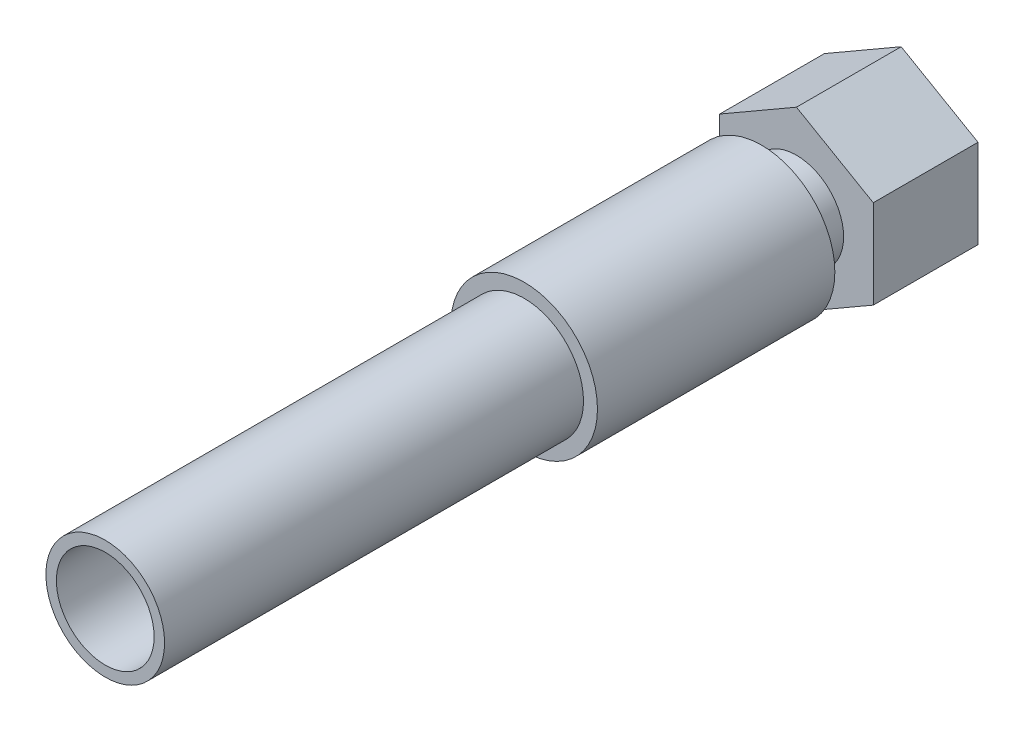
ISO-10303-21;
HEADER;
FILE_DESCRIPTION(('STEP AP214'),'2;1');
FILE_NAME('part.step','',(''),(''),'','','');
FILE_SCHEMA(('AUTOMOTIVE_DESIGN { 1 0 10303 214 1 1 1 1 }'));
ENDSEC;
DATA;
#1=APPLICATION_CONTEXT('core data for automotive mechanical design processes');
#2=APPLICATION_PROTOCOL_DEFINITION('international standard','automotive_design',2000,#1);
#3=PRODUCT_CONTEXT('',#1,'mechanical');
#4=PRODUCT('Part','Part','',(#3));
#5=PRODUCT_RELATED_PRODUCT_CATEGORY('part','',(#4));
#6=PRODUCT_DEFINITION_FORMATION('','',#4);
#7=PRODUCT_DEFINITION_CONTEXT('part definition',#1,'design');
#8=PRODUCT_DEFINITION('design','',#6,#7);
#9=PRODUCT_DEFINITION_SHAPE('','',#8);
#10=(LENGTH_UNIT() NAMED_UNIT(*) SI_UNIT(.MILLI.,.METRE.));
#11=(NAMED_UNIT(*) PLANE_ANGLE_UNIT() SI_UNIT($,.RADIAN.));
#12=(NAMED_UNIT(*) SI_UNIT($,.STERADIAN.) SOLID_ANGLE_UNIT());
#13=UNCERTAINTY_MEASURE_WITH_UNIT(LENGTH_MEASURE(1.E-05),#10,'distance_accuracy_value','');
#14=(GEOMETRIC_REPRESENTATION_CONTEXT(3) GLOBAL_UNCERTAINTY_ASSIGNED_CONTEXT((#13)) GLOBAL_UNIT_ASSIGNED_CONTEXT((#10,
#11,#12)) REPRESENTATION_CONTEXT('',''));
#15=CARTESIAN_POINT('',(0.,0.,0.));
#16=DIRECTION('',(0.,0.,1.));
#17=DIRECTION('',(1.,0.,0.));
#18=AXIS2_PLACEMENT_3D('',#15,#16,#17);
#19=CARTESIAN_POINT('',(11.,6.35085296108589,15.));
#20=DIRECTION('',(-0.5,-0.866025403784439,0.));
#21=DIRECTION('',(0.866025403784439,-0.5,0.));
#22=AXIS2_PLACEMENT_3D('',#19,#20,#21);
#23=PLANE('',#22);
#24=DIRECTION('',(-0.866025403784439,0.5,0.));
#25=VECTOR('',#24,1.);
#26=CARTESIAN_POINT('',(11.,6.35085296108589,0.));
#27=LINE('',#26,#25);
#28=CARTESIAN_POINT('',(11.,6.35085296108589,0.));
#29=VERTEX_POINT('',#28);
#30=CARTESIAN_POINT('',(0.,12.7017059221718,0.));
#31=VERTEX_POINT('',#30);
#32=EDGE_CURVE('E128',#29,#31,#27,.T.);
#33=ORIENTED_EDGE('',*,*,#32,.T.);
#34=DIRECTION('',(0.,0.,-1.));
#35=VECTOR('',#34,1.);
#36=CARTESIAN_POINT('',(0.,12.7017059221718,15.));
#37=LINE('',#36,#35);
#38=CARTESIAN_POINT('',(0.,12.7017059221718,15.));
#39=VERTEX_POINT('',#38);
#40=EDGE_CURVE('E11',#39,#31,#37,.T.);
#41=ORIENTED_EDGE('',*,*,#40,.F.);
#42=DIRECTION('',(-0.866025403784439,0.5,0.));
#43=VECTOR('',#42,1.);
#44=CARTESIAN_POINT('',(11.,6.35085296108589,15.));
#45=LINE('',#44,#43);
#46=CARTESIAN_POINT('',(11.,6.35085296108589,15.));
#47=VERTEX_POINT('',#46);
#48=EDGE_CURVE('E139',#47,#39,#45,.T.);
#49=ORIENTED_EDGE('',*,*,#48,.F.);
#50=DIRECTION('',(0.,0.,-1.));
#51=VECTOR('',#50,1.);
#52=CARTESIAN_POINT('',(11.,6.35085296108589,15.));
#53=LINE('',#52,#51);
#54=EDGE_CURVE('E124',#47,#29,#53,.T.);
#55=ORIENTED_EDGE('',*,*,#54,.T.);
#56=EDGE_LOOP('',(#33,#41,#49,#55));
#57=FACE_BOUND('',#56,.T.);
#58=ADVANCED_FACE('F43',(#57),#23,.F.);
#59=CARTESIAN_POINT('',(0.,12.7017059221718,15.));
#60=DIRECTION('',(0.5,-0.866025403784439,0.));
#61=DIRECTION('',(0.866025403784439,0.5,0.));
#62=AXIS2_PLACEMENT_3D('',#59,#60,#61);
#63=PLANE('',#62);
#64=DIRECTION('',(-0.866025403784439,-0.5,0.));
#65=VECTOR('',#64,1.);
#66=CARTESIAN_POINT('',(0.,12.7017059221718,0.));
#67=LINE('',#66,#65);
#68=CARTESIAN_POINT('',(-11.,6.35085296108589,0.));
#69=VERTEX_POINT('',#68);
#70=EDGE_CURVE('E131',#31,#69,#67,.T.);
#71=ORIENTED_EDGE('',*,*,#70,.T.);
#72=DIRECTION('',(0.,0.,-1.));
#73=VECTOR('',#72,1.);
#74=CARTESIAN_POINT('',(-11.,6.35085296108589,15.));
#75=LINE('',#74,#73);
#76=CARTESIAN_POINT('',(-11.,6.35085296108589,15.));
#77=VERTEX_POINT('',#76);
#78=EDGE_CURVE('E52',#77,#69,#75,.T.);
#79=ORIENTED_EDGE('',*,*,#78,.F.);
#80=DIRECTION('',(-0.866025403784439,-0.5,0.));
#81=VECTOR('',#80,1.);
#82=CARTESIAN_POINT('',(0.,12.7017059221718,15.));
#83=LINE('',#82,#81);
#84=EDGE_CURVE('E97',#39,#77,#83,.T.);
#85=ORIENTED_EDGE('',*,*,#84,.F.);
#86=ORIENTED_EDGE('',*,*,#40,.T.);
#87=EDGE_LOOP('',(#71,#79,#85,#86));
#88=FACE_BOUND('',#87,.T.);
#89=ADVANCED_FACE('F165',(#88),#63,.F.);
#90=CARTESIAN_POINT('',(-11.,6.35085296108589,15.));
#91=DIRECTION('',(1.,0.,0.));
#92=DIRECTION('',(0.,0.,-1.));
#93=AXIS2_PLACEMENT_3D('',#90,#91,#92);
#94=PLANE('',#93);
#95=DIRECTION('',(0.,-1.,0.));
#96=VECTOR('',#95,1.);
#97=CARTESIAN_POINT('',(-11.,6.35085296108589,0.));
#98=LINE('',#97,#96);
#99=CARTESIAN_POINT('',(-11.,-6.35085296108588,0.));
#100=VERTEX_POINT('',#99);
#101=EDGE_CURVE('E134',#69,#100,#98,.T.);
#102=ORIENTED_EDGE('',*,*,#101,.T.);
#103=DIRECTION('',(0.,0.,-1.));
#104=VECTOR('',#103,1.);
#105=CARTESIAN_POINT('',(-11.,-6.35085296108588,15.));
#106=LINE('',#105,#104);
#107=CARTESIAN_POINT('',(-11.,-6.35085296108588,15.));
#108=VERTEX_POINT('',#107);
#109=EDGE_CURVE('E119',#108,#100,#106,.T.);
#110=ORIENTED_EDGE('',*,*,#109,.F.);
#111=DIRECTION('',(0.,-1.,0.));
#112=VECTOR('',#111,1.);
#113=CARTESIAN_POINT('',(-11.,6.35085296108589,15.));
#114=LINE('',#113,#112);
#115=EDGE_CURVE('E110',#77,#108,#114,.T.);
#116=ORIENTED_EDGE('',*,*,#115,.F.);
#117=ORIENTED_EDGE('',*,*,#78,.T.);
#118=EDGE_LOOP('',(#102,#110,#116,#117));
#119=FACE_BOUND('',#118,.T.);
#120=ADVANCED_FACE('F146',(#119),#94,.F.);
#121=CARTESIAN_POINT('',(-11.,-6.35085296108588,15.));
#122=DIRECTION('',(0.5,0.866025403784439,0.));
#123=DIRECTION('',(-0.866025403784439,0.5,0.));
#124=AXIS2_PLACEMENT_3D('',#121,#122,#123);
#125=PLANE('',#124);
#126=DIRECTION('',(0.866025403784438,-0.5,0.));
#127=VECTOR('',#126,1.);
#128=CARTESIAN_POINT('',(-11.,-6.35085296108588,0.));
#129=LINE('',#128,#127);
#130=CARTESIAN_POINT('',(0.,-12.7017059221718,0.));
#131=VERTEX_POINT('',#130);
#132=EDGE_CURVE('E118',#100,#131,#129,.T.);
#133=ORIENTED_EDGE('',*,*,#132,.T.);
#134=DIRECTION('',(0.,0.,-1.));
#135=VECTOR('',#134,1.);
#136=CARTESIAN_POINT('',(0.,-12.7017059221718,15.));
#137=LINE('',#136,#135);
#138=CARTESIAN_POINT('',(0.,-12.7017059221718,15.));
#139=VERTEX_POINT('',#138);
#140=EDGE_CURVE('E115',#139,#131,#137,.T.);
#141=ORIENTED_EDGE('',*,*,#140,.F.);
#142=DIRECTION('',(0.866025403784438,-0.5,0.));
#143=VECTOR('',#142,1.);
#144=CARTESIAN_POINT('',(-11.,-6.35085296108588,15.));
#145=LINE('',#144,#143);
#146=EDGE_CURVE('E104',#108,#139,#145,.T.);
#147=ORIENTED_EDGE('',*,*,#146,.F.);
#148=ORIENTED_EDGE('',*,*,#109,.T.);
#149=EDGE_LOOP('',(#133,#141,#147,#148));
#150=FACE_BOUND('',#149,.T.);
#151=ADVANCED_FACE('F116',(#150),#125,.F.);
#152=CARTESIAN_POINT('',(0.,-12.7017059221718,15.));
#153=DIRECTION('',(-0.5,0.866025403784439,0.));
#154=DIRECTION('',(-0.866025403784439,-0.5,0.));
#155=AXIS2_PLACEMENT_3D('',#152,#153,#154);
#156=PLANE('',#155);
#157=DIRECTION('',(0.866025403784439,0.5,0.));
#158=VECTOR('',#157,1.);
#159=CARTESIAN_POINT('',(0.,-12.7017059221718,0.));
#160=LINE('',#159,#158);
#161=CARTESIAN_POINT('',(11.,-6.35085296108589,0.));
#162=VERTEX_POINT('',#161);
#163=EDGE_CURVE('E83',#131,#162,#160,.T.);
#164=ORIENTED_EDGE('',*,*,#163,.T.);
#165=DIRECTION('',(0.,0.,-1.));
#166=VECTOR('',#165,1.);
#167=CARTESIAN_POINT('',(11.,-6.35085296108589,15.));
#168=LINE('',#167,#166);
#169=CARTESIAN_POINT('',(11.,-6.35085296108589,15.));
#170=VERTEX_POINT('',#169);
#171=EDGE_CURVE('E120',#170,#162,#168,.T.);
#172=ORIENTED_EDGE('',*,*,#171,.F.);
#173=DIRECTION('',(0.866025403784439,0.5,0.));
#174=VECTOR('',#173,1.);
#175=CARTESIAN_POINT('',(0.,-12.7017059221718,15.));
#176=LINE('',#175,#174);
#177=EDGE_CURVE('E108',#139,#170,#176,.T.);
#178=ORIENTED_EDGE('',*,*,#177,.F.);
#179=ORIENTED_EDGE('',*,*,#140,.T.);
#180=EDGE_LOOP('',(#164,#172,#178,#179));
#181=FACE_BOUND('',#180,.T.);
#182=ADVANCED_FACE('F122',(#181),#156,.F.);
#183=CARTESIAN_POINT('',(11.,-6.35085296108589,15.));
#184=DIRECTION('',(-1.,0.,0.));
#185=DIRECTION('',(0.,-1.,0.));
#186=AXIS2_PLACEMENT_3D('',#183,#184,#185);
#187=PLANE('',#186);
#188=DIRECTION('',(0.,1.,0.));
#189=VECTOR('',#188,1.);
#190=CARTESIAN_POINT('',(11.,-6.35085296108589,0.));
#191=LINE('',#190,#189);
#192=EDGE_CURVE('E89',#162,#29,#191,.T.);
#193=ORIENTED_EDGE('',*,*,#192,.T.);
#194=ORIENTED_EDGE('',*,*,#54,.F.);
#195=DIRECTION('',(0.,1.,0.));
#196=VECTOR('',#195,1.);
#197=CARTESIAN_POINT('',(11.,-6.35085296108589,15.));
#198=LINE('',#197,#196);
#199=EDGE_CURVE('E60',#170,#47,#198,.T.);
#200=ORIENTED_EDGE('',*,*,#199,.F.);
#201=ORIENTED_EDGE('',*,*,#171,.T.);
#202=EDGE_LOOP('',(#193,#194,#200,#201));
#203=FACE_BOUND('',#202,.T.);
#204=ADVANCED_FACE('F153',(#203),#187,.F.);
#205=CARTESIAN_POINT('',(0.,12.7017059221718,15.));
#206=DIRECTION('',(0.,0.,1.));
#207=DIRECTION('',(1.,0.,0.));
#208=AXIS2_PLACEMENT_3D('',#205,#206,#207);
#209=PLANE('',#208);
#210=CARTESIAN_POINT('',(0.,0.,15.));
#211=DIRECTION('',(0.,0.,1.));
#212=DIRECTION('',(1.,0.,0.));
#213=AXIS2_PLACEMENT_3D('',#210,#211,#212);
#214=CIRCLE('',#213,6.75);
#215=CARTESIAN_POINT('',(6.75,0.,15.));
#216=VERTEX_POINT('',#215);
#217=EDGE_CURVE('E414',#216,#216,#214,.T.);
#218=ORIENTED_EDGE('',*,*,#217,.F.);
#219=EDGE_LOOP('',(#218));
#220=FACE_BOUND('',#219,.T.);
#221=ORIENTED_EDGE('',*,*,#48,.T.);
#222=ORIENTED_EDGE('',*,*,#84,.T.);
#223=ORIENTED_EDGE('',*,*,#115,.T.);
#224=ORIENTED_EDGE('',*,*,#146,.T.);
#225=ORIENTED_EDGE('',*,*,#177,.T.);
#226=ORIENTED_EDGE('',*,*,#199,.T.);
#227=EDGE_LOOP('',(#221,#222,#223,#224,#225,#226));
#228=FACE_BOUND('',#227,.T.);
#229=ADVANCED_FACE('F106',(#220,#228),#209,.T.);
#230=CARTESIAN_POINT('',(0.,12.7017059221718,0.));
#231=DIRECTION('',(0.,0.,1.));
#232=DIRECTION('',(1.,0.,0.));
#233=AXIS2_PLACEMENT_3D('',#230,#231,#232);
#234=PLANE('',#233);
#235=CARTESIAN_POINT('',(0.,0.,0.));
#236=DIRECTION('',(0.,0.,-1.));
#237=DIRECTION('',(-1.,0.,0.));
#238=AXIS2_PLACEMENT_3D('',#235,#236,#237);
#239=CIRCLE('',#238,8.331);
#240=CARTESIAN_POINT('',(-8.331,0.,0.));
#241=VERTEX_POINT('',#240);
#242=EDGE_CURVE('E426',#241,#241,#239,.T.);
#243=ORIENTED_EDGE('',*,*,#242,.F.);
#244=EDGE_LOOP('',(#243));
#245=FACE_BOUND('',#244,.T.);
#246=ORIENTED_EDGE('',*,*,#32,.F.);
#247=ORIENTED_EDGE('',*,*,#192,.F.);
#248=ORIENTED_EDGE('',*,*,#163,.F.);
#249=ORIENTED_EDGE('',*,*,#132,.F.);
#250=ORIENTED_EDGE('',*,*,#101,.F.);
#251=ORIENTED_EDGE('',*,*,#70,.F.);
#252=EDGE_LOOP('',(#246,#247,#248,#249,#250,#251));
#253=FACE_BOUND('',#252,.T.);
#254=ADVANCED_FACE('F149',(#245,#253),#234,.F.);
#255=CARTESIAN_POINT('',(0.,0.,12.));
#256=DIRECTION('',(0.,0.,-1.));
#257=DIRECTION('',(-1.,0.,0.));
#258=AXIS2_PLACEMENT_3D('',#255,#256,#257);
#259=CYLINDRICAL_SURFACE('',#258,8.331);
#260=CARTESIAN_POINT('',(0.,0.,12.));
#261=DIRECTION('',(0.,0.,-1.));
#262=DIRECTION('',(-1.,0.,0.));
#263=AXIS2_PLACEMENT_3D('',#260,#261,#262);
#264=CIRCLE('',#263,8.331);
#265=CARTESIAN_POINT('',(-8.331,0.,12.));
#266=VERTEX_POINT('',#265);
#267=EDGE_CURVE('E132',#266,#266,#264,.T.);
#268=ORIENTED_EDGE('',*,*,#267,.F.);
#269=EDGE_LOOP('',(#268));
#270=FACE_BOUND('',#269,.T.);
#271=ORIENTED_EDGE('',*,*,#242,.T.);
#272=EDGE_LOOP('',(#271));
#273=FACE_BOUND('',#272,.T.);
#274=ADVANCED_FACE('F204',(#270,#273),#259,.F.);
#275=CARTESIAN_POINT('',(0.,0.,12.));
#276=DIRECTION('',(0.,0.,-1.));
#277=DIRECTION('',(-1.,0.,0.));
#278=AXIS2_PLACEMENT_3D('',#275,#276,#277);
#279=PLANE('',#278);
#280=CARTESIAN_POINT('',(0.,0.,12.));
#281=DIRECTION('',(0.,0.,-1.));
#282=DIRECTION('',(-1.,0.,0.));
#283=AXIS2_PLACEMENT_3D('',#280,#281,#282);
#284=CIRCLE('',#283,7.);
#285=CARTESIAN_POINT('',(-7.,0.,12.));
#286=VERTEX_POINT('',#285);
#287=EDGE_CURVE('E423',#286,#286,#284,.T.);
#288=ORIENTED_EDGE('',*,*,#287,.F.);
#289=EDGE_LOOP('',(#288));
#290=FACE_BOUND('',#289,.T.);
#291=ORIENTED_EDGE('',*,*,#267,.T.);
#292=EDGE_LOOP('',(#291));
#293=FACE_BOUND('',#292,.T.);
#294=ADVANCED_FACE('F214',(#290,#293),#279,.T.);
#295=CARTESIAN_POINT('',(0.,0.,12.));
#296=DIRECTION('',(0.,0.,-1.));
#297=DIRECTION('',(-1.,0.,0.));
#298=AXIS2_PLACEMENT_3D('',#295,#296,#297);
#299=CYLINDRICAL_SURFACE('',#298,7.);
#300=ORIENTED_EDGE('',*,*,#287,.T.);
#301=EDGE_LOOP('',(#300));
#302=FACE_BOUND('',#301,.T.);
#303=CARTESIAN_POINT('',(0.,0.,0.));
#304=DIRECTION('',(0.,0.,-1.));
#305=DIRECTION('',(-1.,0.,0.));
#306=AXIS2_PLACEMENT_3D('',#303,#304,#305);
#307=CIRCLE('',#306,7.);
#308=CARTESIAN_POINT('',(-7.,0.,0.));
#309=VERTEX_POINT('',#308);
#310=EDGE_CURVE('E420',#309,#309,#307,.T.);
#311=ORIENTED_EDGE('',*,*,#310,.F.);
#312=EDGE_LOOP('',(#311));
#313=FACE_BOUND('',#312,.T.);
#314=ADVANCED_FACE('F224',(#302,#313),#299,.T.);
#315=CARTESIAN_POINT('',(0.,0.,0.));
#316=DIRECTION('',(0.,0.,-1.));
#317=DIRECTION('',(-1.,0.,0.));
#318=AXIS2_PLACEMENT_3D('',#315,#316,#317);
#319=CIRCLE('',#318,3.5);
#320=CARTESIAN_POINT('',(-3.5,0.,0.));
#321=VERTEX_POINT('',#320);
#322=EDGE_CURVE('E395',#321,#321,#319,.T.);
#323=ORIENTED_EDGE('',*,*,#322,.F.);
#324=EDGE_LOOP('',(#323));
#325=FACE_BOUND('',#324,.T.);
#326=ORIENTED_EDGE('',*,*,#310,.T.);
#327=EDGE_LOOP('',(#326));
#328=FACE_BOUND('',#327,.T.);
#329=ADVANCED_FACE('F206',(#325,#328),#234,.F.);
#330=CARTESIAN_POINT('',(0.,0.,20.));
#331=DIRECTION('',(0.,0.,-1.));
#332=DIRECTION('',(-1.,0.,0.));
#333=AXIS2_PLACEMENT_3D('',#330,#331,#332);
#334=CYLINDRICAL_SURFACE('',#333,6.75);
#335=CARTESIAN_POINT('',(0.,0.,20.));
#336=DIRECTION('',(0.,0.,1.));
#337=DIRECTION('',(1.,0.,0.));
#338=AXIS2_PLACEMENT_3D('',#335,#336,#337);
#339=CIRCLE('',#338,6.75);
#340=CARTESIAN_POINT('',(6.75,0.,20.));
#341=VERTEX_POINT('',#340);
#342=EDGE_CURVE('E417',#341,#341,#339,.T.);
#343=ORIENTED_EDGE('',*,*,#342,.F.);
#344=EDGE_LOOP('',(#343));
#345=FACE_BOUND('',#344,.T.);
#346=ORIENTED_EDGE('',*,*,#217,.T.);
#347=EDGE_LOOP('',(#346));
#348=FACE_BOUND('',#347,.T.);
#349=ADVANCED_FACE('F242',(#345,#348),#334,.T.);
#350=CARTESIAN_POINT('',(0.,0.,54.));
#351=DIRECTION('',(0.,0.,-1.));
#352=DIRECTION('',(-1.,0.,0.));
#353=AXIS2_PLACEMENT_3D('',#350,#351,#352);
#354=CYLINDRICAL_SURFACE('',#353,10.5);
#355=CARTESIAN_POINT('',(0.,0.,54.));
#356=DIRECTION('',(0.,0.,1.));
#357=DIRECTION('',(1.,0.,0.));
#358=AXIS2_PLACEMENT_3D('',#355,#356,#357);
#359=CIRCLE('',#358,10.5);
#360=CARTESIAN_POINT('',(10.5,0.,54.));
#361=VERTEX_POINT('',#360);
#362=EDGE_CURVE('E411',#361,#361,#359,.T.);
#363=ORIENTED_EDGE('',*,*,#362,.F.);
#364=EDGE_LOOP('',(#363));
#365=FACE_BOUND('',#364,.T.);
#366=CARTESIAN_POINT('',(0.,0.,20.));
#367=DIRECTION('',(0.,0.,1.));
#368=DIRECTION('',(1.,0.,0.));
#369=AXIS2_PLACEMENT_3D('',#366,#367,#368);
#370=CIRCLE('',#369,10.5);
#371=CARTESIAN_POINT('',(10.5,0.,20.));
#372=VERTEX_POINT('',#371);
#373=EDGE_CURVE('E408',#372,#372,#370,.T.);
#374=ORIENTED_EDGE('',*,*,#373,.T.);
#375=EDGE_LOOP('',(#374));
#376=FACE_BOUND('',#375,.T.);
#377=ADVANCED_FACE('F252',(#365,#376),#354,.T.);
#378=CARTESIAN_POINT('',(0.,0.,54.));
#379=DIRECTION('',(0.,0.,1.));
#380=DIRECTION('',(1.,0.,0.));
#381=AXIS2_PLACEMENT_3D('',#378,#379,#380);
#382=PLANE('',#381);
#383=CARTESIAN_POINT('',(0.,0.,54.));
#384=DIRECTION('',(0.,0.,1.));
#385=DIRECTION('',(1.,0.,0.));
#386=AXIS2_PLACEMENT_3D('',#383,#384,#385);
#387=CIRCLE('',#386,8.5);
#388=CARTESIAN_POINT('',(8.5,0.,54.));
#389=VERTEX_POINT('',#388);
#390=EDGE_CURVE('E402',#389,#389,#387,.T.);
#391=ORIENTED_EDGE('',*,*,#390,.F.);
#392=EDGE_LOOP('',(#391));
#393=FACE_BOUND('',#392,.T.);
#394=ORIENTED_EDGE('',*,*,#362,.T.);
#395=EDGE_LOOP('',(#394));
#396=FACE_BOUND('',#395,.T.);
#397=ADVANCED_FACE('F262',(#393,#396),#382,.T.);
#398=CARTESIAN_POINT('',(0.,0.,20.));
#399=DIRECTION('',(0.,0.,1.));
#400=DIRECTION('',(1.,0.,0.));
#401=AXIS2_PLACEMENT_3D('',#398,#399,#400);
#402=PLANE('',#401);
#403=ORIENTED_EDGE('',*,*,#342,.T.);
#404=EDGE_LOOP('',(#403));
#405=FACE_BOUND('',#404,.T.);
#406=ORIENTED_EDGE('',*,*,#373,.F.);
#407=EDGE_LOOP('',(#406));
#408=FACE_BOUND('',#407,.T.);
#409=ADVANCED_FACE('F273',(#405,#408),#402,.F.);
#410=CARTESIAN_POINT('',(0.,0.,114.));
#411=DIRECTION('',(0.,0.,-1.));
#412=DIRECTION('',(-1.,0.,0.));
#413=AXIS2_PLACEMENT_3D('',#410,#411,#412);
#414=CYLINDRICAL_SURFACE('',#413,8.5);
#415=CARTESIAN_POINT('',(0.,0.,114.));
#416=DIRECTION('',(0.,0.,1.));
#417=DIRECTION('',(1.,0.,0.));
#418=AXIS2_PLACEMENT_3D('',#415,#416,#417);
#419=CIRCLE('',#418,8.5);
#420=CARTESIAN_POINT('',(8.5,0.,114.));
#421=VERTEX_POINT('',#420);
#422=EDGE_CURVE('E405',#421,#421,#419,.T.);
#423=ORIENTED_EDGE('',*,*,#422,.F.);
#424=EDGE_LOOP('',(#423));
#425=FACE_BOUND('',#424,.T.);
#426=ORIENTED_EDGE('',*,*,#390,.T.);
#427=EDGE_LOOP('',(#426));
#428=FACE_BOUND('',#427,.T.);
#429=ADVANCED_FACE('F283',(#425,#428),#414,.T.);
#430=CARTESIAN_POINT('',(0.,0.,114.));
#431=DIRECTION('',(0.,0.,1.));
#432=DIRECTION('',(1.,0.,0.));
#433=AXIS2_PLACEMENT_3D('',#430,#431,#432);
#434=PLANE('',#433);
#435=CARTESIAN_POINT('',(0.,0.,114.));
#436=DIRECTION('',(0.,0.,1.));
#437=DIRECTION('',(1.,0.,0.));
#438=AXIS2_PLACEMENT_3D('',#435,#436,#437);
#439=CIRCLE('',#438,7.);
#440=CARTESIAN_POINT('',(7.,0.,114.));
#441=VERTEX_POINT('',#440);
#442=EDGE_CURVE('E397',#441,#441,#439,.T.);
#443=ORIENTED_EDGE('',*,*,#442,.F.);
#444=EDGE_LOOP('',(#443));
#445=FACE_BOUND('',#444,.T.);
#446=ORIENTED_EDGE('',*,*,#422,.T.);
#447=EDGE_LOOP('',(#446));
#448=FACE_BOUND('',#447,.T.);
#449=ADVANCED_FACE('F292',(#445,#448),#434,.T.);
#450=CARTESIAN_POINT('',(0.,0.,54.));
#451=DIRECTION('',(0.,0.,1.));
#452=DIRECTION('',(1.,0.,0.));
#453=AXIS2_PLACEMENT_3D('',#450,#451,#452);
#454=CYLINDRICAL_SURFACE('',#453,7.);
#455=CARTESIAN_POINT('',(0.,0.,54.));
#456=DIRECTION('',(0.,0.,1.));
#457=DIRECTION('',(1.,0.,0.));
#458=AXIS2_PLACEMENT_3D('',#455,#456,#457);
#459=CIRCLE('',#458,7.);
#460=CARTESIAN_POINT('',(7.,0.,54.));
#461=VERTEX_POINT('',#460);
#462=EDGE_CURVE('E399',#461,#461,#459,.T.);
#463=ORIENTED_EDGE('',*,*,#462,.F.);
#464=EDGE_LOOP('',(#463));
#465=FACE_BOUND('',#464,.T.);
#466=ORIENTED_EDGE('',*,*,#442,.T.);
#467=EDGE_LOOP('',(#466));
#468=FACE_BOUND('',#467,.T.);
#469=ADVANCED_FACE('F302',(#465,#468),#454,.F.);
#470=CARTESIAN_POINT('',(0.,0.,54.));
#471=DIRECTION('',(0.,0.,1.));
#472=DIRECTION('',(1.,0.,0.));
#473=AXIS2_PLACEMENT_3D('',#470,#471,#472);
#474=PLANE('',#473);
#475=CARTESIAN_POINT('',(0.,0.,54.));
#476=DIRECTION('',(0.,0.,1.));
#477=DIRECTION('',(1.,0.,0.));
#478=AXIS2_PLACEMENT_3D('',#475,#476,#477);
#479=CIRCLE('',#478,3.5);
#480=CARTESIAN_POINT('',(3.5,0.,54.));
#481=VERTEX_POINT('',#480);
#482=EDGE_CURVE('E46',#481,#481,#479,.T.);
#483=ORIENTED_EDGE('',*,*,#482,.F.);
#484=EDGE_LOOP('',(#483));
#485=FACE_BOUND('',#484,.T.);
#486=ORIENTED_EDGE('',*,*,#462,.T.);
#487=EDGE_LOOP('',(#486));
#488=FACE_BOUND('',#487,.T.);
#489=ADVANCED_FACE('F311',(#485,#488),#474,.T.);
#490=CARTESIAN_POINT('',(0.,0.,114.));
#491=DIRECTION('',(0.,0.,-1.));
#492=DIRECTION('',(-1.,0.,0.));
#493=AXIS2_PLACEMENT_3D('',#490,#491,#492);
#494=CYLINDRICAL_SURFACE('',#493,3.5);
#495=ORIENTED_EDGE('',*,*,#482,.T.);
#496=EDGE_LOOP('',(#495));
#497=FACE_BOUND('',#496,.T.);
#498=ORIENTED_EDGE('',*,*,#322,.T.);
#499=EDGE_LOOP('',(#498));
#500=FACE_BOUND('',#499,.T.);
#501=ADVANCED_FACE('F320',(#497,#500),#494,.F.);
#502=CLOSED_SHELL('',(#58,#89,#120,#151,#182,#204,#229,#254,#274,#294,#314,#329,#349,#377,#397,
#409,#429,#449,#469,#489,#501));
#503=MANIFOLD_SOLID_BREP('B2',#502);
#504=ADVANCED_BREP_SHAPE_REPRESENTATION('',(#18,#503),#14);
#505=SHAPE_DEFINITION_REPRESENTATION(#9,#504);
ENDSEC;
END-ISO-10303-21;
